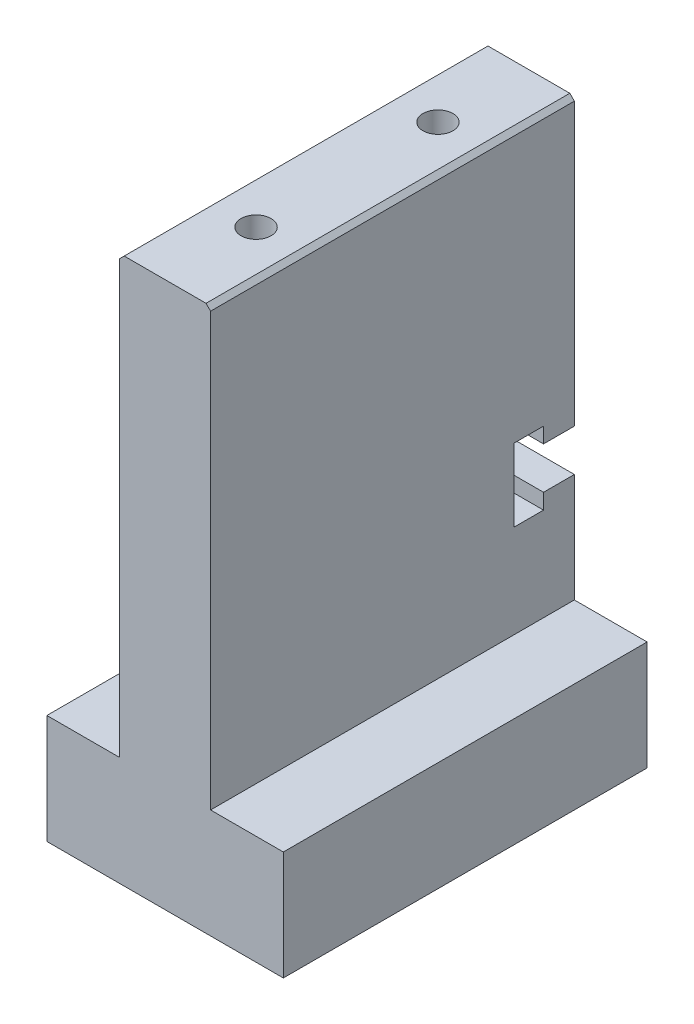
ISO-10303-21;
HEADER;
FILE_DESCRIPTION(('STEP AP214'),'2;1');
FILE_NAME('part.step','',(''),(''),'','','');
FILE_SCHEMA(('AUTOMOTIVE_DESIGN { 1 0 10303 214 1 1 1 1 }'));
ENDSEC;
DATA;
#1=APPLICATION_CONTEXT('core data for automotive mechanical design processes');
#2=APPLICATION_PROTOCOL_DEFINITION('international standard','automotive_design',2000,#1);
#3=PRODUCT_CONTEXT('',#1,'mechanical');
#4=PRODUCT('Part','Part','',(#3));
#5=PRODUCT_RELATED_PRODUCT_CATEGORY('part','',(#4));
#6=PRODUCT_DEFINITION_FORMATION('','',#4);
#7=PRODUCT_DEFINITION_CONTEXT('part definition',#1,'design');
#8=PRODUCT_DEFINITION('design','',#6,#7);
#9=PRODUCT_DEFINITION_SHAPE('','',#8);
#10=(LENGTH_UNIT() NAMED_UNIT(*) SI_UNIT(.MILLI.,.METRE.));
#11=(NAMED_UNIT(*) PLANE_ANGLE_UNIT() SI_UNIT($,.RADIAN.));
#12=(NAMED_UNIT(*) SI_UNIT($,.STERADIAN.) SOLID_ANGLE_UNIT());
#13=UNCERTAINTY_MEASURE_WITH_UNIT(LENGTH_MEASURE(1.E-05),#10,'distance_accuracy_value','');
#14=(GEOMETRIC_REPRESENTATION_CONTEXT(3) GLOBAL_UNCERTAINTY_ASSIGNED_CONTEXT((#13)) GLOBAL_UNIT_ASSIGNED_CONTEXT((#10,
#11,#12)) REPRESENTATION_CONTEXT('',''));
#15=CARTESIAN_POINT('',(0.,0.,0.));
#16=DIRECTION('',(0.,0.,1.));
#17=DIRECTION('',(1.,0.,0.));
#18=AXIS2_PLACEMENT_3D('',#15,#16,#17);
#19=CARTESIAN_POINT('',(0.,0.,0.));
#20=DIRECTION('',(0.,0.,1.));
#21=DIRECTION('',(1.,0.,0.));
#22=AXIS2_PLACEMENT_3D('',#19,#20,#21);
#23=PLANE('',#22);
#24=CARTESIAN_POINT('',(2.11058823529412,51.2917647058824,0.));
#25=DIRECTION('',(0.,0.,-1.));
#26=DIRECTION('',(-1.,0.,0.));
#27=AXIS2_PLACEMENT_3D('',#24,#25,#26);
#28=CIRCLE('',#27,1.24999999999999);
#29=CARTESIAN_POINT('',(0.860588235294133,51.2917647058824,0.));
#30=VERTEX_POINT('',#29);
#31=EDGE_CURVE('E206',#30,#30,#28,.T.);
#32=ORIENTED_EDGE('',*,*,#31,.F.);
#33=EDGE_LOOP('',(#32));
#34=FACE_BOUND('',#33,.T.);
#35=DIRECTION('',(-1.,0.,0.));
#36=VECTOR('',#35,1.);
#37=CARTESIAN_POINT('',(-2.88941176470588,53.2917647058824,0.));
#38=LINE('',#37,#36);
#39=CARTESIAN_POINT('',(6.61058823529413,53.2917647058824,0.));
#40=VERTEX_POINT('',#39);
#41=CARTESIAN_POINT('',(-2.38941176470588,53.2917647058824,0.));
#42=VERTEX_POINT('',#41);
#43=EDGE_CURVE('E254',#40,#42,#38,.T.);
#44=ORIENTED_EDGE('',*,*,#43,.F.);
#45=DIRECTION('',(0.707106781186543,-0.707106781186552,0.));
#46=VECTOR('',#45,1.);
#47=CARTESIAN_POINT('',(6.61058823529413,53.2917647058824,0.));
#48=LINE('',#47,#46);
#49=CARTESIAN_POINT('',(7.11058823529412,52.7917647058824,0.));
#50=VERTEX_POINT('',#49);
#51=EDGE_CURVE('E335',#40,#50,#48,.T.);
#52=ORIENTED_EDGE('',*,*,#51,.T.);
#53=DIRECTION('',(0.,-1.,0.));
#54=VECTOR('',#53,1.);
#55=CARTESIAN_POINT('',(7.11058823529412,53.2917647058824,0.));
#56=LINE('',#55,#54);
#57=CARTESIAN_POINT('',(7.11058823529412,21.8417647058824,0.));
#58=VERTEX_POINT('',#57);
#59=EDGE_CURVE('E266',#50,#58,#56,.T.);
#60=ORIENTED_EDGE('',*,*,#59,.T.);
#61=DIRECTION('',(-1.,0.,0.));
#62=VECTOR('',#61,1.);
#63=CARTESIAN_POINT('',(45.1105882352941,21.8417647058824,0.));
#64=LINE('',#63,#62);
#65=CARTESIAN_POINT('',(-2.88941176470588,21.8417647058824,0.));
#66=VERTEX_POINT('',#65);
#67=EDGE_CURVE('E234',#58,#66,#64,.T.);
#68=ORIENTED_EDGE('',*,*,#67,.T.);
#69=DIRECTION('',(0.,-1.,0.));
#70=VECTOR('',#69,1.);
#71=CARTESIAN_POINT('',(-2.88941176470588,53.2917647058824,0.));
#72=LINE('',#71,#70);
#73=CARTESIAN_POINT('',(-2.88941176470588,52.7917647058824,0.));
#74=VERTEX_POINT('',#73);
#75=EDGE_CURVE('E263',#74,#66,#72,.T.);
#76=ORIENTED_EDGE('',*,*,#75,.F.);
#77=DIRECTION('',(0.707106781186543,0.707106781186552,0.));
#78=VECTOR('',#77,1.);
#79=CARTESIAN_POINT('',(-2.38941176470588,53.2917647058824,0.));
#80=LINE('',#79,#78);
#81=EDGE_CURVE('E333',#74,#42,#80,.T.);
#82=ORIENTED_EDGE('',*,*,#81,.T.);
#83=EDGE_LOOP('',(#44,#52,#60,#68,#76,#82));
#84=FACE_BOUND('',#83,.T.);
#85=ADVANCED_FACE('F35',(#34,#84),#23,.F.);
#86=CARTESIAN_POINT('',(-10.8894117647059,5.29176470588235,40.));
#87=DIRECTION('',(0.,-1.,0.));
#88=DIRECTION('',(0.,0.,-1.));
#89=AXIS2_PLACEMENT_3D('',#86,#87,#88);
#90=PLANE('',#89);
#91=DIRECTION('',(0.,0.,1.));
#92=VECTOR('',#91,1.);
#93=CARTESIAN_POINT('',(-2.88941176470588,5.29176470588235,0.));
#94=LINE('',#93,#92);
#95=CARTESIAN_POINT('',(-2.88941176470588,5.29176470588235,0.));
#96=VERTEX_POINT('',#95);
#97=CARTESIAN_POINT('',(-2.88941176470588,5.29176470588235,40.));
#98=VERTEX_POINT('',#97);
#99=EDGE_CURVE('E237',#96,#98,#94,.T.);
#100=ORIENTED_EDGE('',*,*,#99,.F.);
#101=DIRECTION('',(-1.,0.,0.));
#102=VECTOR('',#101,1.);
#103=CARTESIAN_POINT('',(-10.8894117647059,5.29176470588235,0.));
#104=LINE('',#103,#102);
#105=CARTESIAN_POINT('',(-10.8894117647059,5.29176470588235,0.));
#106=VERTEX_POINT('',#105);
#107=EDGE_CURVE('E292',#96,#106,#104,.T.);
#108=ORIENTED_EDGE('',*,*,#107,.T.);
#109=DIRECTION('',(0.,0.,-1.));
#110=VECTOR('',#109,1.);
#111=CARTESIAN_POINT('',(-10.8894117647059,5.29176470588235,40.));
#112=LINE('',#111,#110);
#113=CARTESIAN_POINT('',(-10.8894117647059,5.29176470588235,40.));
#114=VERTEX_POINT('',#113);
#115=EDGE_CURVE('E285',#114,#106,#112,.T.);
#116=ORIENTED_EDGE('',*,*,#115,.F.);
#117=DIRECTION('',(-1.,0.,0.));
#118=VECTOR('',#117,1.);
#119=CARTESIAN_POINT('',(-10.8894117647059,5.29176470588235,40.));
#120=LINE('',#119,#118);
#121=EDGE_CURVE('E281',#98,#114,#120,.T.);
#122=ORIENTED_EDGE('',*,*,#121,.F.);
#123=EDGE_LOOP('',(#100,#108,#116,#122));
#124=FACE_BOUND('',#123,.T.);
#125=ADVANCED_FACE('F369',(#124),#90,.F.);
#126=DIRECTION('',(0.,0.,-1.));
#127=VECTOR('',#126,1.);
#128=CARTESIAN_POINT('',(7.11058823529412,5.29176470588235,0.));
#129=LINE('',#128,#127);
#130=CARTESIAN_POINT('',(7.11058823529412,5.29176470588235,40.));
#131=VERTEX_POINT('',#130);
#132=CARTESIAN_POINT('',(7.11058823529412,5.29176470588235,0.));
#133=VERTEX_POINT('',#132);
#134=EDGE_CURVE('E255',#131,#133,#129,.T.);
#135=ORIENTED_EDGE('',*,*,#134,.F.);
#136=CARTESIAN_POINT('',(15.1105882352941,5.29176470588235,40.));
#137=VERTEX_POINT('',#136);
#138=EDGE_CURVE('E282',#137,#131,#120,.T.);
#139=ORIENTED_EDGE('',*,*,#138,.F.);
#140=DIRECTION('',(0.,0.,-1.));
#141=VECTOR('',#140,1.);
#142=CARTESIAN_POINT('',(15.1105882352941,5.29176470588235,40.));
#143=LINE('',#142,#141);
#144=CARTESIAN_POINT('',(15.1105882352941,5.29176470588235,0.));
#145=VERTEX_POINT('',#144);
#146=EDGE_CURVE('E297',#137,#145,#143,.T.);
#147=ORIENTED_EDGE('',*,*,#146,.T.);
#148=EDGE_CURVE('E277',#145,#133,#104,.T.);
#149=ORIENTED_EDGE('',*,*,#148,.T.);
#150=EDGE_LOOP('',(#135,#139,#147,#149));
#151=FACE_BOUND('',#150,.T.);
#152=ADVANCED_FACE('F388',(#151),#90,.F.);
#153=CARTESIAN_POINT('',(-10.8894117647059,5.29176470588235,40.));
#154=DIRECTION('',(1.,0.,0.));
#155=DIRECTION('',(0.,0.,-1.));
#156=AXIS2_PLACEMENT_3D('',#153,#154,#155);
#157=PLANE('',#156);
#158=DIRECTION('',(0.,-1.,0.));
#159=VECTOR('',#158,1.);
#160=CARTESIAN_POINT('',(-10.8894117647059,5.29176470588235,0.));
#161=LINE('',#160,#159);
#162=CARTESIAN_POINT('',(-10.8894117647059,-6.70823529411765,0.));
#163=VERTEX_POINT('',#162);
#164=EDGE_CURVE('E272',#106,#163,#161,.T.);
#165=ORIENTED_EDGE('',*,*,#164,.T.);
#166=DIRECTION('',(0.,0.,-1.));
#167=VECTOR('',#166,1.);
#168=CARTESIAN_POINT('',(-10.8894117647059,-6.70823529411765,40.));
#169=LINE('',#168,#167);
#170=CARTESIAN_POINT('',(-10.8894117647059,-6.70823529411765,40.));
#171=VERTEX_POINT('',#170);
#172=EDGE_CURVE('E303',#171,#163,#169,.T.);
#173=ORIENTED_EDGE('',*,*,#172,.F.);
#174=DIRECTION('',(0.,-1.,0.));
#175=VECTOR('',#174,1.);
#176=CARTESIAN_POINT('',(-10.8894117647059,5.29176470588235,40.));
#177=LINE('',#176,#175);
#178=EDGE_CURVE('E273',#114,#171,#177,.T.);
#179=ORIENTED_EDGE('',*,*,#178,.F.);
#180=ORIENTED_EDGE('',*,*,#115,.T.);
#181=EDGE_LOOP('',(#165,#173,#179,#180));
#182=FACE_BOUND('',#181,.T.);
#183=ADVANCED_FACE('F375',(#182),#157,.F.);
#184=CARTESIAN_POINT('',(-10.8894117647059,-6.70823529411765,40.));
#185=DIRECTION('',(0.,1.,0.));
#186=DIRECTION('',(0.,0.,1.));
#187=AXIS2_PLACEMENT_3D('',#184,#185,#186);
#188=PLANE('',#187);
#189=DIRECTION('',(1.,0.,0.));
#190=VECTOR('',#189,1.);
#191=CARTESIAN_POINT('',(-10.8894117647059,-6.70823529411765,0.));
#192=LINE('',#191,#190);
#193=CARTESIAN_POINT('',(15.1105882352941,-6.70823529411765,0.));
#194=VERTEX_POINT('',#193);
#195=EDGE_CURVE('E288',#163,#194,#192,.T.);
#196=ORIENTED_EDGE('',*,*,#195,.T.);
#197=DIRECTION('',(0.,0.,-1.));
#198=VECTOR('',#197,1.);
#199=CARTESIAN_POINT('',(15.1105882352941,-6.70823529411765,40.));
#200=LINE('',#199,#198);
#201=CARTESIAN_POINT('',(15.1105882352941,-6.70823529411765,40.));
#202=VERTEX_POINT('',#201);
#203=EDGE_CURVE('E300',#202,#194,#200,.T.);
#204=ORIENTED_EDGE('',*,*,#203,.F.);
#205=DIRECTION('',(1.,0.,0.));
#206=VECTOR('',#205,1.);
#207=CARTESIAN_POINT('',(-10.8894117647059,-6.70823529411765,40.));
#208=LINE('',#207,#206);
#209=EDGE_CURVE('E276',#171,#202,#208,.T.);
#210=ORIENTED_EDGE('',*,*,#209,.F.);
#211=ORIENTED_EDGE('',*,*,#172,.T.);
#212=EDGE_LOOP('',(#196,#204,#210,#211));
#213=FACE_BOUND('',#212,.T.);
#214=ADVANCED_FACE('F380',(#213),#188,.F.);
#215=CARTESIAN_POINT('',(15.1105882352941,5.29176470588235,40.));
#216=DIRECTION('',(-1.,0.,0.));
#217=DIRECTION('',(0.,-1.,0.));
#218=AXIS2_PLACEMENT_3D('',#215,#216,#217);
#219=PLANE('',#218);
#220=DIRECTION('',(0.,1.,0.));
#221=VECTOR('',#220,1.);
#222=CARTESIAN_POINT('',(15.1105882352941,5.29176470588235,0.));
#223=LINE('',#222,#221);
#224=EDGE_CURVE('E290',#194,#145,#223,.T.);
#225=ORIENTED_EDGE('',*,*,#224,.T.);
#226=ORIENTED_EDGE('',*,*,#146,.F.);
#227=DIRECTION('',(0.,1.,0.));
#228=VECTOR('',#227,1.);
#229=CARTESIAN_POINT('',(15.1105882352941,5.29176470588235,40.));
#230=LINE('',#229,#228);
#231=EDGE_CURVE('E279',#202,#137,#230,.T.);
#232=ORIENTED_EDGE('',*,*,#231,.F.);
#233=ORIENTED_EDGE('',*,*,#203,.T.);
#234=EDGE_LOOP('',(#225,#226,#232,#233));
#235=FACE_BOUND('',#234,.T.);
#236=ADVANCED_FACE('F383',(#235),#219,.F.);
#237=CARTESIAN_POINT('',(0.,0.,40.));
#238=DIRECTION('',(0.,0.,1.));
#239=DIRECTION('',(1.,0.,0.));
#240=AXIS2_PLACEMENT_3D('',#237,#238,#239);
#241=PLANE('',#240);
#242=DIRECTION('',(0.,-1.,0.));
#243=VECTOR('',#242,1.);
#244=CARTESIAN_POINT('',(7.11058823529413,53.2917647058824,40.));
#245=LINE('',#244,#243);
#246=CARTESIAN_POINT('',(7.11058823529413,52.7917647058824,40.));
#247=VERTEX_POINT('',#246);
#248=EDGE_CURVE('E268',#247,#131,#245,.T.);
#249=ORIENTED_EDGE('',*,*,#248,.F.);
#250=DIRECTION('',(-0.707106781186543,0.707106781186552,0.));
#251=VECTOR('',#250,1.);
#252=CARTESIAN_POINT('',(29.9511764705883,29.9511764705879,40.));
#253=LINE('',#252,#251);
#254=CARTESIAN_POINT('',(6.61058823529413,53.2917647058824,40.));
#255=VERTEX_POINT('',#254);
#256=EDGE_CURVE('E43',#247,#255,#253,.T.);
#257=ORIENTED_EDGE('',*,*,#256,.T.);
#258=DIRECTION('',(1.,0.,0.));
#259=VECTOR('',#258,1.);
#260=CARTESIAN_POINT('',(-2.88941176470587,53.2917647058824,40.));
#261=LINE('',#260,#259);
#262=CARTESIAN_POINT('',(-2.38941176470588,53.2917647058824,40.));
#263=VERTEX_POINT('',#262);
#264=EDGE_CURVE('E251',#263,#255,#261,.T.);
#265=ORIENTED_EDGE('',*,*,#264,.F.);
#266=DIRECTION('',(-0.707106781186543,-0.707106781186552,0.));
#267=VECTOR('',#266,1.);
#268=CARTESIAN_POINT('',(-27.8405882352941,27.8405882352937,40.));
#269=LINE('',#268,#267);
#270=CARTESIAN_POINT('',(-2.88941176470587,52.7917647058824,40.));
#271=VERTEX_POINT('',#270);
#272=EDGE_CURVE('E50',#263,#271,#269,.T.);
#273=ORIENTED_EDGE('',*,*,#272,.T.);
#274=DIRECTION('',(0.,-1.,0.));
#275=VECTOR('',#274,1.);
#276=CARTESIAN_POINT('',(-2.88941176470587,53.2917647058824,40.));
#277=LINE('',#276,#275);
#278=EDGE_CURVE('E270',#271,#98,#277,.T.);
#279=ORIENTED_EDGE('',*,*,#278,.T.);
#280=ORIENTED_EDGE('',*,*,#121,.T.);
#281=ORIENTED_EDGE('',*,*,#178,.T.);
#282=ORIENTED_EDGE('',*,*,#209,.T.);
#283=ORIENTED_EDGE('',*,*,#231,.T.);
#284=ORIENTED_EDGE('',*,*,#138,.T.);
#285=EDGE_LOOP('',(#249,#257,#265,#273,#279,#280,#281,#282,#283,#284));
#286=FACE_BOUND('',#285,.T.);
#287=ADVANCED_FACE('F339',(#286),#241,.T.);
#288=CARTESIAN_POINT('',(9.11058823529412,-0.708235294117647,0.));
#289=DIRECTION('',(0.,0.,-1.));
#290=DIRECTION('',(-1.,0.,0.));
#291=AXIS2_PLACEMENT_3D('',#288,#289,#290);
#292=CIRCLE('',#291,1.24999999999999);
#293=CARTESIAN_POINT('',(7.86058823529413,-0.708235294117647,0.));
#294=VERTEX_POINT('',#293);
#295=EDGE_CURVE('E194',#294,#294,#292,.T.);
#296=ORIENTED_EDGE('',*,*,#295,.F.);
#297=EDGE_LOOP('',(#296));
#298=FACE_BOUND('',#297,.T.);
#299=CARTESIAN_POINT('',(-4.88941176470588,-0.708235294117647,0.));
#300=DIRECTION('',(0.,0.,-1.));
#301=DIRECTION('',(-1.,0.,0.));
#302=AXIS2_PLACEMENT_3D('',#299,#300,#301);
#303=CIRCLE('',#302,1.24999999999999);
#304=CARTESIAN_POINT('',(-6.13941176470587,-0.708235294117647,0.));
#305=VERTEX_POINT('',#304);
#306=EDGE_CURVE('E200',#305,#305,#303,.T.);
#307=ORIENTED_EDGE('',*,*,#306,.F.);
#308=EDGE_LOOP('',(#307));
#309=FACE_BOUND('',#308,.T.);
#310=CARTESIAN_POINT('',(-2.88941176470588,17.2417647058824,0.));
#311=VERTEX_POINT('',#310);
#312=EDGE_CURVE('E258',#311,#96,#72,.T.);
#313=ORIENTED_EDGE('',*,*,#312,.F.);
#314=DIRECTION('',(-1.,0.,0.));
#315=VECTOR('',#314,1.);
#316=CARTESIAN_POINT('',(45.1105882352941,17.2417647058824,0.));
#317=LINE('',#316,#315);
#318=CARTESIAN_POINT('',(7.11058823529412,17.2417647058824,0.));
#319=VERTEX_POINT('',#318);
#320=EDGE_CURVE('E233',#319,#311,#317,.T.);
#321=ORIENTED_EDGE('',*,*,#320,.F.);
#322=EDGE_CURVE('E265',#319,#133,#56,.T.);
#323=ORIENTED_EDGE('',*,*,#322,.T.);
#324=ORIENTED_EDGE('',*,*,#148,.F.);
#325=ORIENTED_EDGE('',*,*,#224,.F.);
#326=ORIENTED_EDGE('',*,*,#195,.F.);
#327=ORIENTED_EDGE('',*,*,#164,.F.);
#328=ORIENTED_EDGE('',*,*,#107,.F.);
#329=EDGE_LOOP('',(#313,#321,#323,#324,#325,#326,#327,#328));
#330=FACE_BOUND('',#329,.T.);
#331=ADVANCED_FACE('F393',(#298,#309,#330),#23,.F.);
#332=CARTESIAN_POINT('',(-2.88941176470588,53.2917647058824,0.));
#333=DIRECTION('',(1.,0.,0.));
#334=DIRECTION('',(0.,0.,-1.));
#335=AXIS2_PLACEMENT_3D('',#332,#333,#334);
#336=PLANE('',#335);
#337=ORIENTED_EDGE('',*,*,#278,.F.);
#338=DIRECTION('',(0.,0.,-1.));
#339=VECTOR('',#338,1.);
#340=CARTESIAN_POINT('',(-2.88941176470588,52.7917647058824,0.));
#341=LINE('',#340,#339);
#342=EDGE_CURVE('E11',#271,#74,#341,.T.);
#343=ORIENTED_EDGE('',*,*,#342,.T.);
#344=ORIENTED_EDGE('',*,*,#75,.T.);
#345=DIRECTION('',(0.,0.,-1.));
#346=VECTOR('',#345,1.);
#347=CARTESIAN_POINT('',(-2.88941176470588,21.8417647058824,0.));
#348=LINE('',#347,#346);
#349=CARTESIAN_POINT('',(-2.88941176470588,21.8417647058824,3.38976346758652));
#350=VERTEX_POINT('',#349);
#351=EDGE_CURVE('E230',#350,#66,#348,.T.);
#352=ORIENTED_EDGE('',*,*,#351,.F.);
#353=DIRECTION('',(0.,-1.,0.));
#354=VECTOR('',#353,1.);
#355=CARTESIAN_POINT('',(-2.88941176470588,23.5417647058824,3.38976346758652));
#356=LINE('',#355,#354);
#357=CARTESIAN_POINT('',(-2.88941176470588,23.5417647058824,3.38976346758652));
#358=VERTEX_POINT('',#357);
#359=EDGE_CURVE('E227',#358,#350,#356,.T.);
#360=ORIENTED_EDGE('',*,*,#359,.F.);
#361=DIRECTION('',(0.,0.,-1.));
#362=VECTOR('',#361,1.);
#363=CARTESIAN_POINT('',(-2.88941176470588,23.5417647058824,3.38976346758652));
#364=LINE('',#363,#362);
#365=CARTESIAN_POINT('',(-2.88941176470588,23.5417647058824,6.66389663022572));
#366=VERTEX_POINT('',#365);
#367=EDGE_CURVE('E224',#366,#358,#364,.T.);
#368=ORIENTED_EDGE('',*,*,#367,.F.);
#369=DIRECTION('',(0.,1.,0.));
#370=VECTOR('',#369,1.);
#371=CARTESIAN_POINT('',(-2.88941176470588,23.5417647058824,6.66389663022572));
#372=LINE('',#371,#370);
#373=CARTESIAN_POINT('',(-2.88941176470588,15.5417647058824,6.66389663022572));
#374=VERTEX_POINT('',#373);
#375=EDGE_CURVE('E221',#374,#366,#372,.T.);
#376=ORIENTED_EDGE('',*,*,#375,.F.);
#377=DIRECTION('',(0.,0.,1.));
#378=VECTOR('',#377,1.);
#379=CARTESIAN_POINT('',(-2.88941176470588,15.5417647058824,3.38976346758652));
#380=LINE('',#379,#378);
#381=CARTESIAN_POINT('',(-2.88941176470588,15.5417647058824,3.38976346758652));
#382=VERTEX_POINT('',#381);
#383=EDGE_CURVE('E218',#382,#374,#380,.T.);
#384=ORIENTED_EDGE('',*,*,#383,.F.);
#385=DIRECTION('',(0.,-1.,0.));
#386=VECTOR('',#385,1.);
#387=CARTESIAN_POINT('',(-2.88941176470588,17.2417647058824,3.38976346758652));
#388=LINE('',#387,#386);
#389=CARTESIAN_POINT('',(-2.88941176470588,17.2417647058824,3.38976346758652));
#390=VERTEX_POINT('',#389);
#391=EDGE_CURVE('E215',#390,#382,#388,.T.);
#392=ORIENTED_EDGE('',*,*,#391,.F.);
#393=DIRECTION('',(0.,0.,1.));
#394=VECTOR('',#393,1.);
#395=CARTESIAN_POINT('',(-2.88941176470588,17.2417647058824,0.));
#396=LINE('',#395,#394);
#397=EDGE_CURVE('E212',#311,#390,#396,.T.);
#398=ORIENTED_EDGE('',*,*,#397,.F.);
#399=ORIENTED_EDGE('',*,*,#312,.T.);
#400=ORIENTED_EDGE('',*,*,#99,.T.);
#401=EDGE_LOOP('',(#337,#343,#344,#352,#360,#368,#376,#384,#392,#398,#399,#400));
#402=FACE_BOUND('',#401,.T.);
#403=ADVANCED_FACE('F360',(#402),#336,.F.);
#404=CARTESIAN_POINT('',(7.11058823529412,53.2917647058824,0.));
#405=DIRECTION('',(-1.,0.,0.));
#406=DIRECTION('',(0.,0.,1.));
#407=AXIS2_PLACEMENT_3D('',#404,#405,#406);
#408=PLANE('',#407);
#409=ORIENTED_EDGE('',*,*,#59,.F.);
#410=DIRECTION('',(0.,0.,1.));
#411=VECTOR('',#410,1.);
#412=CARTESIAN_POINT('',(7.11058823529413,52.7917647058824,40.));
#413=LINE('',#412,#411);
#414=EDGE_CURVE('E58',#50,#247,#413,.T.);
#415=ORIENTED_EDGE('',*,*,#414,.T.);
#416=ORIENTED_EDGE('',*,*,#248,.T.);
#417=ORIENTED_EDGE('',*,*,#134,.T.);
#418=ORIENTED_EDGE('',*,*,#322,.F.);
#419=DIRECTION('',(0.,0.,1.));
#420=VECTOR('',#419,1.);
#421=CARTESIAN_POINT('',(7.11058823529412,17.2417647058824,0.));
#422=LINE('',#421,#420);
#423=CARTESIAN_POINT('',(7.11058823529412,17.2417647058824,3.38976346758652));
#424=VERTEX_POINT('',#423);
#425=EDGE_CURVE('E306',#319,#424,#422,.T.);
#426=ORIENTED_EDGE('',*,*,#425,.T.);
#427=DIRECTION('',(0.,-1.,0.));
#428=VECTOR('',#427,1.);
#429=CARTESIAN_POINT('',(7.11058823529412,53.2917647058824,3.38976346758651));
#430=LINE('',#429,#428);
#431=CARTESIAN_POINT('',(7.11058823529413,15.5417647058824,3.38976346758651));
#432=VERTEX_POINT('',#431);
#433=EDGE_CURVE('E309',#424,#432,#430,.T.);
#434=ORIENTED_EDGE('',*,*,#433,.T.);
#435=DIRECTION('',(0.,0.,1.));
#436=VECTOR('',#435,1.);
#437=CARTESIAN_POINT('',(7.11058823529412,15.5417647058824,0.));
#438=LINE('',#437,#436);
#439=CARTESIAN_POINT('',(7.11058823529413,15.5417647058824,6.66389663022572));
#440=VERTEX_POINT('',#439);
#441=EDGE_CURVE('E312',#432,#440,#438,.T.);
#442=ORIENTED_EDGE('',*,*,#441,.T.);
#443=DIRECTION('',(0.,1.,0.));
#444=VECTOR('',#443,1.);
#445=CARTESIAN_POINT('',(7.11058823529412,53.2917647058824,6.66389663022572));
#446=LINE('',#445,#444);
#447=CARTESIAN_POINT('',(7.11058823529413,23.5417647058824,6.66389663022572));
#448=VERTEX_POINT('',#447);
#449=EDGE_CURVE('E315',#440,#448,#446,.T.);
#450=ORIENTED_EDGE('',*,*,#449,.T.);
#451=DIRECTION('',(0.,0.,-1.));
#452=VECTOR('',#451,1.);
#453=CARTESIAN_POINT('',(7.11058823529412,23.5417647058824,0.));
#454=LINE('',#453,#452);
#455=CARTESIAN_POINT('',(7.11058823529413,23.5417647058824,3.38976346758651));
#456=VERTEX_POINT('',#455);
#457=EDGE_CURVE('E318',#448,#456,#454,.T.);
#458=ORIENTED_EDGE('',*,*,#457,.T.);
#459=DIRECTION('',(0.,-1.,0.));
#460=VECTOR('',#459,1.);
#461=CARTESIAN_POINT('',(7.11058823529412,53.2917647058824,3.38976346758651));
#462=LINE('',#461,#460);
#463=CARTESIAN_POINT('',(7.11058823529413,21.8417647058824,3.38976346758651));
#464=VERTEX_POINT('',#463);
#465=EDGE_CURVE('E321',#456,#464,#462,.T.);
#466=ORIENTED_EDGE('',*,*,#465,.T.);
#467=DIRECTION('',(0.,0.,-1.));
#468=VECTOR('',#467,1.);
#469=CARTESIAN_POINT('',(7.11058823529412,21.8417647058824,0.));
#470=LINE('',#469,#468);
#471=EDGE_CURVE('E324',#464,#58,#470,.T.);
#472=ORIENTED_EDGE('',*,*,#471,.T.);
#473=EDGE_LOOP('',(#409,#415,#416,#417,#418,#426,#434,#442,#450,#458,#466,#472));
#474=FACE_BOUND('',#473,.T.);
#475=ADVANCED_FACE('F349',(#474),#408,.F.);
#476=CARTESIAN_POINT('',(0.,53.2917647058824,0.));
#477=DIRECTION('',(0.,1.,0.));
#478=DIRECTION('',(0.,0.,1.));
#479=AXIS2_PLACEMENT_3D('',#476,#477,#478);
#480=PLANE('',#479);
#481=CARTESIAN_POINT('',(2.11058823529412,53.2917647058824,10.));
#482=DIRECTION('',(0.,1.,0.));
#483=DIRECTION('',(0.,0.,1.));
#484=AXIS2_PLACEMENT_3D('',#481,#482,#483);
#485=CIRCLE('',#484,1.65);
#486=CARTESIAN_POINT('',(2.11058823529412,53.2917647058824,11.65));
#487=VERTEX_POINT('',#486);
#488=EDGE_CURVE('E184',#487,#487,#485,.T.);
#489=ORIENTED_EDGE('',*,*,#488,.F.);
#490=EDGE_LOOP('',(#489));
#491=FACE_BOUND('',#490,.T.);
#492=CARTESIAN_POINT('',(2.11058823529412,53.2917647058824,30.));
#493=DIRECTION('',(0.,1.,0.));
#494=DIRECTION('',(0.,0.,1.));
#495=AXIS2_PLACEMENT_3D('',#492,#493,#494);
#496=CIRCLE('',#495,1.65);
#497=CARTESIAN_POINT('',(2.11058823529412,53.2917647058824,31.65));
#498=VERTEX_POINT('',#497);
#499=EDGE_CURVE('E183',#498,#498,#496,.T.);
#500=ORIENTED_EDGE('',*,*,#499,.F.);
#501=EDGE_LOOP('',(#500));
#502=FACE_BOUND('',#501,.T.);
#503=ORIENTED_EDGE('',*,*,#264,.T.);
#504=DIRECTION('',(0.,0.,-1.));
#505=VECTOR('',#504,1.);
#506=CARTESIAN_POINT('',(6.61058823529413,53.2917647058824,0.));
#507=LINE('',#506,#505);
#508=EDGE_CURVE('E330',#255,#40,#507,.T.);
#509=ORIENTED_EDGE('',*,*,#508,.T.);
#510=ORIENTED_EDGE('',*,*,#43,.T.);
#511=DIRECTION('',(0.,0.,1.));
#512=VECTOR('',#511,1.);
#513=CARTESIAN_POINT('',(-2.38941176470588,53.2917647058824,40.));
#514=LINE('',#513,#512);
#515=EDGE_CURVE('E327',#42,#263,#514,.T.);
#516=ORIENTED_EDGE('',*,*,#515,.T.);
#517=EDGE_LOOP('',(#503,#509,#510,#516));
#518=FACE_BOUND('',#517,.T.);
#519=ADVANCED_FACE('F343',(#491,#502,#518),#480,.T.);
#520=CARTESIAN_POINT('',(45.1105882352941,21.8417647058824,0.));
#521=DIRECTION('',(0.,1.,0.));
#522=DIRECTION('',(0.,0.,1.));
#523=AXIS2_PLACEMENT_3D('',#520,#521,#522);
#524=PLANE('',#523);
#525=DIRECTION('',(-1.,0.,0.));
#526=VECTOR('',#525,1.);
#527=CARTESIAN_POINT('',(45.1105882352941,21.8417647058824,3.38976346758651));
#528=LINE('',#527,#526);
#529=EDGE_CURVE('E238',#464,#350,#528,.T.);
#530=ORIENTED_EDGE('',*,*,#529,.T.);
#531=ORIENTED_EDGE('',*,*,#351,.T.);
#532=ORIENTED_EDGE('',*,*,#67,.F.);
#533=ORIENTED_EDGE('',*,*,#471,.F.);
#534=EDGE_LOOP('',(#530,#531,#532,#533));
#535=FACE_BOUND('',#534,.T.);
#536=ADVANCED_FACE('F352',(#535),#524,.F.);
#537=CARTESIAN_POINT('',(45.1105882352941,23.5417647058824,3.38976346758651));
#538=DIRECTION('',(0.,0.,-1.));
#539=DIRECTION('',(-1.,0.,0.));
#540=AXIS2_PLACEMENT_3D('',#537,#538,#539);
#541=PLANE('',#540);
#542=DIRECTION('',(-1.,0.,0.));
#543=VECTOR('',#542,1.);
#544=CARTESIAN_POINT('',(45.1105882352941,23.5417647058824,3.38976346758651));
#545=LINE('',#544,#543);
#546=EDGE_CURVE('E240',#456,#358,#545,.T.);
#547=ORIENTED_EDGE('',*,*,#546,.T.);
#548=ORIENTED_EDGE('',*,*,#359,.T.);
#549=ORIENTED_EDGE('',*,*,#529,.F.);
#550=ORIENTED_EDGE('',*,*,#465,.F.);
#551=EDGE_LOOP('',(#547,#548,#549,#550));
#552=FACE_BOUND('',#551,.T.);
#553=ADVANCED_FACE('F354',(#552),#541,.F.);
#554=CARTESIAN_POINT('',(45.1105882352941,23.5417647058824,3.38976346758651));
#555=DIRECTION('',(0.,1.,0.));
#556=DIRECTION('',(0.,0.,1.));
#557=AXIS2_PLACEMENT_3D('',#554,#555,#556);
#558=PLANE('',#557);
#559=DIRECTION('',(-1.,0.,0.));
#560=VECTOR('',#559,1.);
#561=CARTESIAN_POINT('',(45.1105882352941,23.5417647058824,6.66389663022572));
#562=LINE('',#561,#560);
#563=EDGE_CURVE('E242',#448,#366,#562,.T.);
#564=ORIENTED_EDGE('',*,*,#563,.T.);
#565=ORIENTED_EDGE('',*,*,#367,.T.);
#566=ORIENTED_EDGE('',*,*,#546,.F.);
#567=ORIENTED_EDGE('',*,*,#457,.F.);
#568=EDGE_LOOP('',(#564,#565,#566,#567));
#569=FACE_BOUND('',#568,.T.);
#570=ADVANCED_FACE('F411',(#569),#558,.F.);
#571=CARTESIAN_POINT('',(45.1105882352941,23.5417647058824,6.66389663022572));
#572=DIRECTION('',(0.,0.,1.));
#573=DIRECTION('',(1.,0.,0.));
#574=AXIS2_PLACEMENT_3D('',#571,#572,#573);
#575=PLANE('',#574);
#576=DIRECTION('',(-1.,0.,0.));
#577=VECTOR('',#576,1.);
#578=CARTESIAN_POINT('',(45.1105882352941,15.5417647058824,6.66389663022572));
#579=LINE('',#578,#577);
#580=EDGE_CURVE('E244',#440,#374,#579,.T.);
#581=ORIENTED_EDGE('',*,*,#580,.T.);
#582=ORIENTED_EDGE('',*,*,#375,.T.);
#583=ORIENTED_EDGE('',*,*,#563,.F.);
#584=ORIENTED_EDGE('',*,*,#449,.F.);
#585=EDGE_LOOP('',(#581,#582,#583,#584));
#586=FACE_BOUND('',#585,.T.);
#587=ADVANCED_FACE('F408',(#586),#575,.F.);
#588=CARTESIAN_POINT('',(45.1105882352941,15.5417647058824,3.38976346758651));
#589=DIRECTION('',(0.,-1.,0.));
#590=DIRECTION('',(0.,0.,-1.));
#591=AXIS2_PLACEMENT_3D('',#588,#589,#590);
#592=PLANE('',#591);
#593=DIRECTION('',(-1.,0.,0.));
#594=VECTOR('',#593,1.);
#595=CARTESIAN_POINT('',(45.1105882352941,15.5417647058824,3.38976346758651));
#596=LINE('',#595,#594);
#597=EDGE_CURVE('E246',#432,#382,#596,.T.);
#598=ORIENTED_EDGE('',*,*,#597,.T.);
#599=ORIENTED_EDGE('',*,*,#383,.T.);
#600=ORIENTED_EDGE('',*,*,#580,.F.);
#601=ORIENTED_EDGE('',*,*,#441,.F.);
#602=EDGE_LOOP('',(#598,#599,#600,#601));
#603=FACE_BOUND('',#602,.T.);
#604=ADVANCED_FACE('F406',(#603),#592,.F.);
#605=CARTESIAN_POINT('',(45.1105882352941,17.2417647058824,3.38976346758651));
#606=DIRECTION('',(0.,0.,-1.));
#607=DIRECTION('',(0.,1.,0.));
#608=AXIS2_PLACEMENT_3D('',#605,#606,#607);
#609=PLANE('',#608);
#610=DIRECTION('',(-1.,0.,0.));
#611=VECTOR('',#610,1.);
#612=CARTESIAN_POINT('',(45.1105882352941,17.2417647058824,3.38976346758651));
#613=LINE('',#612,#611);
#614=EDGE_CURVE('E248',#424,#390,#613,.T.);
#615=ORIENTED_EDGE('',*,*,#614,.T.);
#616=ORIENTED_EDGE('',*,*,#391,.T.);
#617=ORIENTED_EDGE('',*,*,#597,.F.);
#618=ORIENTED_EDGE('',*,*,#433,.F.);
#619=EDGE_LOOP('',(#615,#616,#617,#618));
#620=FACE_BOUND('',#619,.T.);
#621=ADVANCED_FACE('F402',(#620),#609,.F.);
#622=CARTESIAN_POINT('',(45.1105882352941,17.2417647058824,0.));
#623=DIRECTION('',(0.,-1.,0.));
#624=DIRECTION('',(0.,0.,-1.));
#625=AXIS2_PLACEMENT_3D('',#622,#623,#624);
#626=PLANE('',#625);
#627=ORIENTED_EDGE('',*,*,#320,.T.);
#628=ORIENTED_EDGE('',*,*,#397,.T.);
#629=ORIENTED_EDGE('',*,*,#614,.F.);
#630=ORIENTED_EDGE('',*,*,#425,.F.);
#631=EDGE_LOOP('',(#627,#628,#629,#630));
#632=FACE_BOUND('',#631,.T.);
#633=ADVANCED_FACE('F396',(#632),#626,.F.);
#634=CARTESIAN_POINT('',(2.11058823529412,51.2917647058824,6.));
#635=DIRECTION('',(0.,0.,-1.));
#636=DIRECTION('',(-1.,0.,0.));
#637=AXIS2_PLACEMENT_3D('',#634,#635,#636);
#638=CONICAL_SURFACE('',#637,1.25,1.02974425867665);
#639=CARTESIAN_POINT('',(2.11058823529412,51.2917647058824,6.75107577378445));
#640=VERTEX_POINT('',#639);
#641=VERTEX_LOOP('',#640);
#642=FACE_BOUND('',#641,.T.);
#643=CARTESIAN_POINT('',(2.11058823529412,51.2917647058824,6.));
#644=DIRECTION('',(0.,0.,-1.));
#645=DIRECTION('',(-1.,0.,0.));
#646=AXIS2_PLACEMENT_3D('',#643,#644,#645);
#647=CIRCLE('',#646,1.25);
#648=CARTESIAN_POINT('',(0.860588235294123,51.2917647058824,6.));
#649=VERTEX_POINT('',#648);
#650=EDGE_CURVE('E209',#649,#649,#647,.T.);
#651=ORIENTED_EDGE('',*,*,#650,.T.);
#652=EDGE_LOOP('',(#651));
#653=FACE_BOUND('',#652,.T.);
#654=ADVANCED_FACE('F461',(#642,#653),#638,.F.);
#655=CARTESIAN_POINT('',(2.11058823529412,51.2917647058824,0.));
#656=DIRECTION('',(0.,0.,-1.));
#657=DIRECTION('',(-1.,0.,0.));
#658=AXIS2_PLACEMENT_3D('',#655,#656,#657);
#659=CYLINDRICAL_SURFACE('',#658,1.24999999999999);
#660=ORIENTED_EDGE('',*,*,#650,.F.);
#661=EDGE_LOOP('',(#660));
#662=FACE_BOUND('',#661,.T.);
#663=ORIENTED_EDGE('',*,*,#31,.T.);
#664=EDGE_LOOP('',(#663));
#665=FACE_BOUND('',#664,.T.);
#666=ADVANCED_FACE('F453',(#662,#665),#659,.F.);
#667=CARTESIAN_POINT('',(-4.88941176470588,-0.708235294117647,6.));
#668=DIRECTION('',(0.,0.,-1.));
#669=DIRECTION('',(-1.,0.,0.));
#670=AXIS2_PLACEMENT_3D('',#667,#668,#669);
#671=CONICAL_SURFACE('',#670,1.25,1.02974425867665);
#672=CARTESIAN_POINT('',(-4.88941176470588,-0.708235294117647,6.75107577378445));
#673=VERTEX_POINT('',#672);
#674=VERTEX_LOOP('',#673);
#675=FACE_BOUND('',#674,.T.);
#676=CARTESIAN_POINT('',(-4.88941176470588,-0.708235294117647,6.));
#677=DIRECTION('',(0.,0.,-1.));
#678=DIRECTION('',(-1.,0.,0.));
#679=AXIS2_PLACEMENT_3D('',#676,#677,#678);
#680=CIRCLE('',#679,1.25);
#681=CARTESIAN_POINT('',(-6.13941176470588,-0.708235294117647,6.));
#682=VERTEX_POINT('',#681);
#683=EDGE_CURVE('E203',#682,#682,#680,.T.);
#684=ORIENTED_EDGE('',*,*,#683,.T.);
#685=EDGE_LOOP('',(#684));
#686=FACE_BOUND('',#685,.T.);
#687=ADVANCED_FACE('F443',(#675,#686),#671,.F.);
#688=CARTESIAN_POINT('',(-4.88941176470588,-0.708235294117647,0.));
#689=DIRECTION('',(0.,0.,-1.));
#690=DIRECTION('',(-1.,0.,0.));
#691=AXIS2_PLACEMENT_3D('',#688,#689,#690);
#692=CYLINDRICAL_SURFACE('',#691,1.24999999999999);
#693=ORIENTED_EDGE('',*,*,#683,.F.);
#694=EDGE_LOOP('',(#693));
#695=FACE_BOUND('',#694,.T.);
#696=ORIENTED_EDGE('',*,*,#306,.T.);
#697=EDGE_LOOP('',(#696));
#698=FACE_BOUND('',#697,.T.);
#699=ADVANCED_FACE('F440',(#695,#698),#692,.F.);
#700=CARTESIAN_POINT('',(9.11058823529412,-0.708235294117647,6.));
#701=DIRECTION('',(0.,0.,-1.));
#702=DIRECTION('',(-1.,0.,0.));
#703=AXIS2_PLACEMENT_3D('',#700,#701,#702);
#704=CONICAL_SURFACE('',#703,1.25,1.02974425867665);
#705=CARTESIAN_POINT('',(9.11058823529412,-0.708235294117647,6.75107577378445));
#706=VERTEX_POINT('',#705);
#707=VERTEX_LOOP('',#706);
#708=FACE_BOUND('',#707,.T.);
#709=CARTESIAN_POINT('',(9.11058823529412,-0.708235294117647,6.));
#710=DIRECTION('',(0.,0.,-1.));
#711=DIRECTION('',(-1.,0.,0.));
#712=AXIS2_PLACEMENT_3D('',#709,#710,#711);
#713=CIRCLE('',#712,1.25);
#714=CARTESIAN_POINT('',(7.86058823529412,-0.708235294117647,6.));
#715=VERTEX_POINT('',#714);
#716=EDGE_CURVE('E197',#715,#715,#713,.T.);
#717=ORIENTED_EDGE('',*,*,#716,.T.);
#718=EDGE_LOOP('',(#717));
#719=FACE_BOUND('',#718,.T.);
#720=ADVANCED_FACE('F442',(#708,#719),#704,.F.);
#721=CARTESIAN_POINT('',(9.11058823529412,-0.708235294117647,0.));
#722=DIRECTION('',(0.,0.,-1.));
#723=DIRECTION('',(-1.,0.,0.));
#724=AXIS2_PLACEMENT_3D('',#721,#722,#723);
#725=CYLINDRICAL_SURFACE('',#724,1.24999999999999);
#726=ORIENTED_EDGE('',*,*,#716,.F.);
#727=EDGE_LOOP('',(#726));
#728=FACE_BOUND('',#727,.T.);
#729=ORIENTED_EDGE('',*,*,#295,.T.);
#730=EDGE_LOOP('',(#729));
#731=FACE_BOUND('',#730,.T.);
#732=ADVANCED_FACE('F450',(#728,#731),#725,.F.);
#733=CARTESIAN_POINT('',(2.11058823529412,45.2917647058824,30.));
#734=DIRECTION('',(0.,1.,0.));
#735=DIRECTION('',(0.,0.,1.));
#736=AXIS2_PLACEMENT_3D('',#733,#734,#735);
#737=CONICAL_SURFACE('',#736,1.65,1.02974425867665);
#738=CARTESIAN_POINT('',(2.11058823529412,44.3003446844869,30.));
#739=VERTEX_POINT('',#738);
#740=VERTEX_LOOP('',#739);
#741=FACE_BOUND('',#740,.T.);
#742=CARTESIAN_POINT('',(2.11058823529412,45.2917647058824,30.));
#743=DIRECTION('',(0.,1.,0.));
#744=DIRECTION('',(0.,0.,1.));
#745=AXIS2_PLACEMENT_3D('',#742,#743,#744);
#746=CIRCLE('',#745,1.65);
#747=CARTESIAN_POINT('',(2.11058823529412,45.2917647058824,31.65));
#748=VERTEX_POINT('',#747);
#749=EDGE_CURVE('E187',#748,#748,#746,.T.);
#750=ORIENTED_EDGE('',*,*,#749,.T.);
#751=EDGE_LOOP('',(#750));
#752=FACE_BOUND('',#751,.T.);
#753=ADVANCED_FACE('F533',(#741,#752),#737,.F.);
#754=CARTESIAN_POINT('',(2.11058823529412,53.2917647058824,30.));
#755=DIRECTION('',(0.,1.,0.));
#756=DIRECTION('',(0.,0.,1.));
#757=AXIS2_PLACEMENT_3D('',#754,#755,#756);
#758=CYLINDRICAL_SURFACE('',#757,1.65);
#759=ORIENTED_EDGE('',*,*,#749,.F.);
#760=EDGE_LOOP('',(#759));
#761=FACE_BOUND('',#760,.T.);
#762=ORIENTED_EDGE('',*,*,#499,.T.);
#763=EDGE_LOOP('',(#762));
#764=FACE_BOUND('',#763,.T.);
#765=ADVANCED_FACE('F177',(#761,#764),#758,.F.);
#766=CARTESIAN_POINT('',(2.11058823529412,45.2917647058824,10.));
#767=DIRECTION('',(0.,1.,0.));
#768=DIRECTION('',(0.,0.,1.));
#769=AXIS2_PLACEMENT_3D('',#766,#767,#768);
#770=CONICAL_SURFACE('',#769,1.65,1.02974425867665);
#771=CARTESIAN_POINT('',(2.11058823529412,44.3003446844869,10.));
#772=VERTEX_POINT('',#771);
#773=VERTEX_LOOP('',#772);
#774=FACE_BOUND('',#773,.T.);
#775=CARTESIAN_POINT('',(2.11058823529412,45.2917647058824,10.));
#776=DIRECTION('',(0.,1.,0.));
#777=DIRECTION('',(0.,0.,1.));
#778=AXIS2_PLACEMENT_3D('',#775,#776,#777);
#779=CIRCLE('',#778,1.65);
#780=CARTESIAN_POINT('',(2.11058823529412,45.2917647058824,11.65));
#781=VERTEX_POINT('',#780);
#782=EDGE_CURVE('E181',#781,#781,#779,.T.);
#783=ORIENTED_EDGE('',*,*,#782,.T.);
#784=EDGE_LOOP('',(#783));
#785=FACE_BOUND('',#784,.T.);
#786=ADVANCED_FACE('F173',(#774,#785),#770,.F.);
#787=CARTESIAN_POINT('',(2.11058823529412,53.2917647058824,10.));
#788=DIRECTION('',(0.,1.,0.));
#789=DIRECTION('',(0.,0.,1.));
#790=AXIS2_PLACEMENT_3D('',#787,#788,#789);
#791=CYLINDRICAL_SURFACE('',#790,1.65);
#792=ORIENTED_EDGE('',*,*,#782,.F.);
#793=EDGE_LOOP('',(#792));
#794=FACE_BOUND('',#793,.T.);
#795=ORIENTED_EDGE('',*,*,#488,.T.);
#796=EDGE_LOOP('',(#795));
#797=FACE_BOUND('',#796,.T.);
#798=ADVANCED_FACE('F176',(#794,#797),#791,.F.);
#799=CARTESIAN_POINT('',(6.61058823529413,53.2917647058824,0.));
#800=DIRECTION('',(0.707106781186552,0.707106781186543,0.));
#801=DIRECTION('',(0.,0.,1.));
#802=AXIS2_PLACEMENT_3D('',#799,#800,#801);
#803=PLANE('',#802);
#804=ORIENTED_EDGE('',*,*,#256,.F.);
#805=ORIENTED_EDGE('',*,*,#414,.F.);
#806=ORIENTED_EDGE('',*,*,#51,.F.);
#807=ORIENTED_EDGE('',*,*,#508,.F.);
#808=EDGE_LOOP('',(#804,#805,#806,#807));
#809=FACE_BOUND('',#808,.T.);
#810=ADVANCED_FACE('F346',(#809),#803,.T.);
#811=CARTESIAN_POINT('',(-2.38941176470588,53.2917647058824,0.));
#812=DIRECTION('',(-0.707106781186552,0.707106781186543,0.));
#813=DIRECTION('',(0.,0.,-1.));
#814=AXIS2_PLACEMENT_3D('',#811,#812,#813);
#815=PLANE('',#814);
#816=ORIENTED_EDGE('',*,*,#81,.F.);
#817=ORIENTED_EDGE('',*,*,#342,.F.);
#818=ORIENTED_EDGE('',*,*,#272,.F.);
#819=ORIENTED_EDGE('',*,*,#515,.F.);
#820=EDGE_LOOP('',(#816,#817,#818,#819));
#821=FACE_BOUND('',#820,.T.);
#822=ADVANCED_FACE('F37',(#821),#815,.T.);
#823=CLOSED_SHELL('',(#85,#125,#152,#183,#214,#236,#287,#331,#403,#475,#519,#536,#553,#570,#587,
#604,#621,#633,#654,#666,#687,#699,#720,#732,#753,#765,#786,#798,#810,#822));
#824=MANIFOLD_SOLID_BREP('B2',#823);
#825=ADVANCED_BREP_SHAPE_REPRESENTATION('',(#18,#824),#14);
#826=SHAPE_DEFINITION_REPRESENTATION(#9,#825);
ENDSEC;
END-ISO-10303-21;
